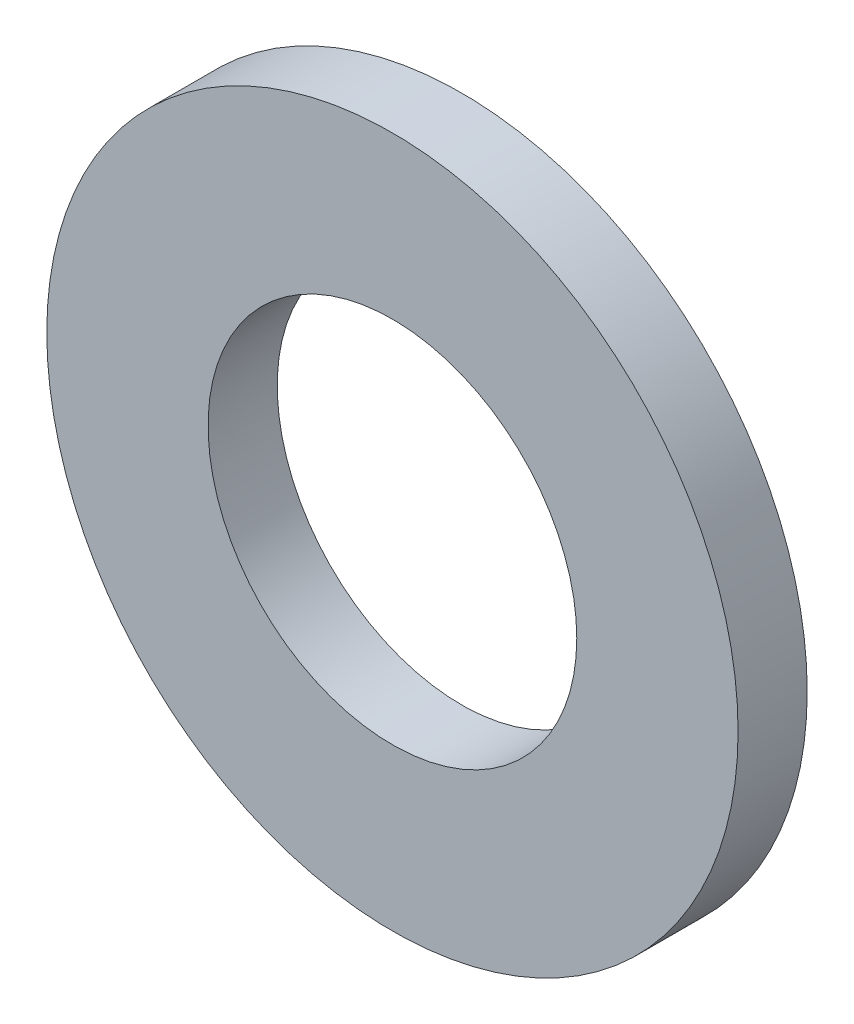
ISO-10303-21;
HEADER;
FILE_DESCRIPTION(('STEP AP214'),'2;1');
FILE_NAME('part.step','',(''),(''),'','','');
FILE_SCHEMA(('AUTOMOTIVE_DESIGN { 1 0 10303 214 1 1 1 1 }'));
ENDSEC;
DATA;
#1=APPLICATION_CONTEXT('core data for automotive mechanical design processes');
#2=APPLICATION_PROTOCOL_DEFINITION('international standard','automotive_design',2000,#1);
#3=PRODUCT_CONTEXT('',#1,'mechanical');
#4=PRODUCT('Part','Part','',(#3));
#5=PRODUCT_RELATED_PRODUCT_CATEGORY('part','',(#4));
#6=PRODUCT_DEFINITION_FORMATION('','',#4);
#7=PRODUCT_DEFINITION_CONTEXT('part definition',#1,'design');
#8=PRODUCT_DEFINITION('design','',#6,#7);
#9=PRODUCT_DEFINITION_SHAPE('','',#8);
#10=(LENGTH_UNIT() NAMED_UNIT(*) SI_UNIT(.MILLI.,.METRE.));
#11=(NAMED_UNIT(*) PLANE_ANGLE_UNIT() SI_UNIT($,.RADIAN.));
#12=(NAMED_UNIT(*) SI_UNIT($,.STERADIAN.) SOLID_ANGLE_UNIT());
#13=UNCERTAINTY_MEASURE_WITH_UNIT(LENGTH_MEASURE(1.E-05),#10,'distance_accuracy_value','');
#14=(GEOMETRIC_REPRESENTATION_CONTEXT(3) GLOBAL_UNCERTAINTY_ASSIGNED_CONTEXT((#13)) GLOBAL_UNIT_ASSIGNED_CONTEXT((#10,
#11,#12)) REPRESENTATION_CONTEXT('',''));
#15=CARTESIAN_POINT('',(0.,0.,0.));
#16=DIRECTION('',(0.,0.,1.));
#17=DIRECTION('',(1.,0.,0.));
#18=AXIS2_PLACEMENT_3D('',#15,#16,#17);
#19=CARTESIAN_POINT('',(0.,0.,0.299999999999999));
#20=DIRECTION('',(0.,0.,1.));
#21=DIRECTION('',(1.,0.,0.));
#22=AXIS2_PLACEMENT_3D('',#19,#20,#21);
#23=PLANE('',#22);
#24=CARTESIAN_POINT('',(0.,0.,0.299999999999999));
#25=DIRECTION('',(0.,0.,1.));
#26=DIRECTION('',(1.,0.,0.));
#27=AXIS2_PLACEMENT_3D('',#24,#25,#26);
#28=CIRCLE('',#27,3.);
#29=CARTESIAN_POINT('',(3.,0.,0.299999999999999));
#30=VERTEX_POINT('',#29);
#31=EDGE_CURVE('E10',#30,#30,#28,.T.);
#32=ORIENTED_EDGE('',*,*,#31,.T.);
#33=EDGE_LOOP('',(#32));
#34=FACE_BOUND('',#33,.T.);
#35=CARTESIAN_POINT('',(0.,0.,0.299999999999999));
#36=DIRECTION('',(0.,0.,1.));
#37=DIRECTION('',(1.,0.,0.));
#38=AXIS2_PLACEMENT_3D('',#35,#36,#37);
#39=CIRCLE('',#38,1.6);
#40=CARTESIAN_POINT('',(1.6,0.,0.299999999999999));
#41=VERTEX_POINT('',#40);
#42=EDGE_CURVE('E37',#41,#41,#39,.T.);
#43=ORIENTED_EDGE('',*,*,#42,.F.);
#44=EDGE_LOOP('',(#43));
#45=FACE_BOUND('',#44,.T.);
#46=ADVANCED_FACE('F30',(#34,#45),#23,.T.);
#47=CARTESIAN_POINT('',(0.,0.,0.299999999999999));
#48=DIRECTION('',(0.,0.,-1.));
#49=DIRECTION('',(-1.,0.,0.));
#50=AXIS2_PLACEMENT_3D('',#47,#48,#49);
#51=CYLINDRICAL_SURFACE('',#50,3.);
#52=ORIENTED_EDGE('',*,*,#31,.F.);
#53=EDGE_LOOP('',(#52));
#54=FACE_BOUND('',#53,.T.);
#55=CARTESIAN_POINT('',(0.,0.,-0.300000000000001));
#56=DIRECTION('',(0.,0.,1.));
#57=DIRECTION('',(1.,0.,0.));
#58=AXIS2_PLACEMENT_3D('',#55,#56,#57);
#59=CIRCLE('',#58,3.);
#60=CARTESIAN_POINT('',(3.,0.,-0.300000000000001));
#61=VERTEX_POINT('',#60);
#62=EDGE_CURVE('E41',#61,#61,#59,.T.);
#63=ORIENTED_EDGE('',*,*,#62,.T.);
#64=EDGE_LOOP('',(#63));
#65=FACE_BOUND('',#64,.T.);
#66=ADVANCED_FACE('F32',(#54,#65),#51,.T.);
#67=CARTESIAN_POINT('',(0.,0.,0.299999999999999));
#68=DIRECTION('',(0.,0.,-1.));
#69=DIRECTION('',(-1.,0.,0.));
#70=AXIS2_PLACEMENT_3D('',#67,#68,#69);
#71=CYLINDRICAL_SURFACE('',#70,1.6);
#72=ORIENTED_EDGE('',*,*,#42,.T.);
#73=EDGE_LOOP('',(#72));
#74=FACE_BOUND('',#73,.T.);
#75=CARTESIAN_POINT('',(0.,0.,-0.300000000000001));
#76=DIRECTION('',(0.,0.,1.));
#77=DIRECTION('',(1.,0.,0.));
#78=AXIS2_PLACEMENT_3D('',#75,#76,#77);
#79=CIRCLE('',#78,1.6);
#80=CARTESIAN_POINT('',(1.6,0.,-0.300000000000001));
#81=VERTEX_POINT('',#80);
#82=EDGE_CURVE('E45',#81,#81,#79,.T.);
#83=ORIENTED_EDGE('',*,*,#82,.F.);
#84=EDGE_LOOP('',(#83));
#85=FACE_BOUND('',#84,.T.);
#86=ADVANCED_FACE('F54',(#74,#85),#71,.F.);
#87=CARTESIAN_POINT('',(0.,0.,-0.300000000000001));
#88=DIRECTION('',(0.,0.,1.));
#89=DIRECTION('',(1.,0.,0.));
#90=AXIS2_PLACEMENT_3D('',#87,#88,#89);
#91=PLANE('',#90);
#92=ORIENTED_EDGE('',*,*,#82,.T.);
#93=EDGE_LOOP('',(#92));
#94=FACE_BOUND('',#93,.T.);
#95=ORIENTED_EDGE('',*,*,#62,.F.);
#96=EDGE_LOOP('',(#95));
#97=FACE_BOUND('',#96,.T.);
#98=ADVANCED_FACE('F51',(#94,#97),#91,.F.);
#99=CLOSED_SHELL('',(#46,#66,#86,#98));
#100=MANIFOLD_SOLID_BREP('B2',#99);
#101=ADVANCED_BREP_SHAPE_REPRESENTATION('',(#18,#100),#14);
#102=SHAPE_DEFINITION_REPRESENTATION(#9,#101);
ENDSEC;
END-ISO-10303-21;
